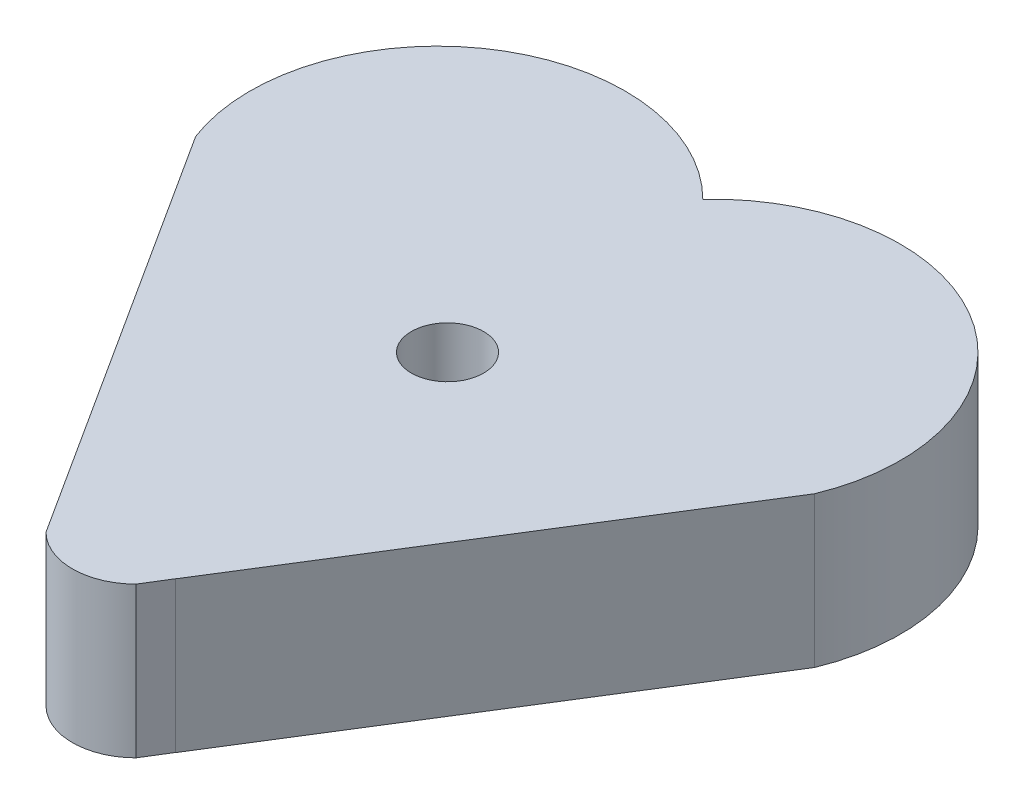
ISO-10303-21;
HEADER;
FILE_DESCRIPTION(('STEP AP214'),'2;1');
FILE_NAME('part.step','',(''),(''),'','','');
FILE_SCHEMA(('AUTOMOTIVE_DESIGN { 1 0 10303 214 1 1 1 1 }'));
ENDSEC;
DATA;
#1=APPLICATION_CONTEXT('core data for automotive mechanical design processes');
#2=APPLICATION_PROTOCOL_DEFINITION('international standard','automotive_design',2000,#1);
#3=PRODUCT_CONTEXT('',#1,'mechanical');
#4=PRODUCT('Part','Part','',(#3));
#5=PRODUCT_RELATED_PRODUCT_CATEGORY('part','',(#4));
#6=PRODUCT_DEFINITION_FORMATION('','',#4);
#7=PRODUCT_DEFINITION_CONTEXT('part definition',#1,'design');
#8=PRODUCT_DEFINITION('design','',#6,#7);
#9=PRODUCT_DEFINITION_SHAPE('','',#8);
#10=(LENGTH_UNIT() NAMED_UNIT(*) SI_UNIT(.MILLI.,.METRE.));
#11=(NAMED_UNIT(*) PLANE_ANGLE_UNIT() SI_UNIT($,.RADIAN.));
#12=(NAMED_UNIT(*) SI_UNIT($,.STERADIAN.) SOLID_ANGLE_UNIT());
#13=UNCERTAINTY_MEASURE_WITH_UNIT(LENGTH_MEASURE(1.E-05),#10,'distance_accuracy_value','');
#14=(GEOMETRIC_REPRESENTATION_CONTEXT(3) GLOBAL_UNCERTAINTY_ASSIGNED_CONTEXT((#13)) GLOBAL_UNIT_ASSIGNED_CONTEXT((#10,
#11,#12)) REPRESENTATION_CONTEXT('',''));
#15=CARTESIAN_POINT('',(0.,0.,0.));
#16=DIRECTION('',(0.,0.,1.));
#17=DIRECTION('',(1.,0.,0.));
#18=AXIS2_PLACEMENT_3D('',#15,#16,#17);
#19=CARTESIAN_POINT('',(4.476994261912,5.08,-4.47699426191201));
#20=DIRECTION('',(0.,-1.,0.));
#21=DIRECTION('',(0.,0.,-1.));
#22=AXIS2_PLACEMENT_3D('',#19,#20,#21);
#23=CYLINDRICAL_SURFACE('',#22,6.33142600386249);
#24=CARTESIAN_POINT('',(4.476994261912,0.,-4.47699426191201));
#25=DIRECTION('',(0.,1.,0.));
#26=DIRECTION('',(0.,0.,1.));
#27=AXIS2_PLACEMENT_3D('',#24,#25,#26);
#28=CIRCLE('',#27,6.33142600386249);
#29=CARTESIAN_POINT('',(10.3291673189757,0.,-2.06058664882935));
#30=VERTEX_POINT('',#29);
#31=CARTESIAN_POINT('',(-0.164422721708759,0.,-8.78329239680036));
#32=VERTEX_POINT('',#31);
#33=EDGE_CURVE('E157',#30,#32,#28,.T.);
#34=ORIENTED_EDGE('',*,*,#33,.T.);
#35=DIRECTION('',(0.,-1.,0.));
#36=VECTOR('',#35,1.);
#37=CARTESIAN_POINT('',(-0.164422721708759,5.08,-8.78329239680036));
#38=LINE('',#37,#36);
#39=CARTESIAN_POINT('',(-0.164422721708759,5.08,-8.78329239680036));
#40=VERTEX_POINT('',#39);
#41=EDGE_CURVE('E11',#40,#32,#38,.T.);
#42=ORIENTED_EDGE('',*,*,#41,.F.);
#43=CARTESIAN_POINT('',(4.476994261912,5.08,-4.47699426191201));
#44=DIRECTION('',(0.,1.,0.));
#45=DIRECTION('',(0.,0.,1.));
#46=AXIS2_PLACEMENT_3D('',#43,#44,#45);
#47=CIRCLE('',#46,6.33142600386249);
#48=CARTESIAN_POINT('',(10.3291673189757,5.08,-2.06058664882935));
#49=VERTEX_POINT('',#48);
#50=EDGE_CURVE('E127',#49,#40,#47,.T.);
#51=ORIENTED_EDGE('',*,*,#50,.F.);
#52=DIRECTION('',(0.,-1.,0.));
#53=VECTOR('',#52,1.);
#54=CARTESIAN_POINT('',(10.3291673189757,5.08,-2.06058664882935));
#55=LINE('',#54,#53);
#56=EDGE_CURVE('E121',#49,#30,#55,.T.);
#57=ORIENTED_EDGE('',*,*,#56,.T.);
#58=EDGE_LOOP('',(#34,#42,#51,#57));
#59=FACE_BOUND('',#58,.T.);
#60=ADVANCED_FACE('F35',(#59),#23,.T.);
#61=CARTESIAN_POINT('',(-4.64141698362076,5.08,-4.30629813488835));
#62=DIRECTION('',(0.,-1.,0.));
#63=DIRECTION('',(0.,0.,-1.));
#64=AXIS2_PLACEMENT_3D('',#61,#62,#63);
#65=CYLINDRICAL_SURFACE('',#64,6.33142600386248);
#66=CARTESIAN_POINT('',(-4.64141698362076,0.,-4.30629813488835));
#67=DIRECTION('',(0.,1.,0.));
#68=DIRECTION('',(0.,0.,1.));
#69=AXIS2_PLACEMENT_3D('',#66,#67,#68);
#70=CIRCLE('',#69,6.33142600386248);
#71=CARTESIAN_POINT('',(-10.5611919087145,0.,-2.06058664882935));
#72=VERTEX_POINT('',#71);
#73=EDGE_CURVE('E155',#32,#72,#70,.T.);
#74=ORIENTED_EDGE('',*,*,#73,.T.);
#75=DIRECTION('',(0.,-1.,0.));
#76=VECTOR('',#75,1.);
#77=CARTESIAN_POINT('',(-10.5611919087145,5.08,-2.06058664882935));
#78=LINE('',#77,#76);
#79=CARTESIAN_POINT('',(-10.5611919087145,5.08,-2.06058664882935));
#80=VERTEX_POINT('',#79);
#81=EDGE_CURVE('E44',#80,#72,#78,.T.);
#82=ORIENTED_EDGE('',*,*,#81,.F.);
#83=CARTESIAN_POINT('',(-4.64141698362076,5.08,-4.30629813488835));
#84=DIRECTION('',(0.,1.,0.));
#85=DIRECTION('',(0.,0.,1.));
#86=AXIS2_PLACEMENT_3D('',#83,#84,#85);
#87=CIRCLE('',#86,6.33142600386248);
#88=EDGE_CURVE('E88',#40,#80,#87,.T.);
#89=ORIENTED_EDGE('',*,*,#88,.F.);
#90=ORIENTED_EDGE('',*,*,#41,.T.);
#91=EDGE_LOOP('',(#74,#82,#89,#90));
#92=FACE_BOUND('',#91,.T.);
#93=ADVANCED_FACE('F177',(#92),#65,.T.);
#94=CARTESIAN_POINT('',(-6.54526239725076,5.08,4.19912507113628));
#95=DIRECTION('',(0.841677864291114,0.,-0.539979974408634));
#96=DIRECTION('',(-0.539979974408634,0.,-0.841677864291114));
#97=AXIS2_PLACEMENT_3D('',#94,#95,#96);
#98=PLANE('',#97);
#99=DIRECTION('',(0.539979974408634,0.,0.841677864291114));
#100=VECTOR('',#99,1.);
#101=CARTESIAN_POINT('',(-6.54526239725076,0.,4.19912507113628));
#102=LINE('',#101,#100);
#103=CARTESIAN_POINT('',(-1.51900155664942,0.,12.0336609616949));
#104=VERTEX_POINT('',#103);
#105=EDGE_CURVE('E150',#72,#104,#102,.T.);
#106=ORIENTED_EDGE('',*,*,#105,.T.);
#107=DIRECTION('',(0.,-1.,0.));
#108=VECTOR('',#107,1.);
#109=CARTESIAN_POINT('',(-1.51900155664942,5.08,12.0336609616949));
#110=LINE('',#109,#108);
#111=CARTESIAN_POINT('',(-1.51900155664942,5.08,12.0336609616949));
#112=VERTEX_POINT('',#111);
#113=EDGE_CURVE('E144',#112,#104,#110,.T.);
#114=ORIENTED_EDGE('',*,*,#113,.F.);
#115=DIRECTION('',(0.539979974408634,0.,0.841677864291114));
#116=VECTOR('',#115,1.);
#117=CARTESIAN_POINT('',(-6.54526239725076,5.08,4.19912507113628));
#118=LINE('',#117,#116);
#119=EDGE_CURVE('E124',#80,#112,#118,.T.);
#120=ORIENTED_EDGE('',*,*,#119,.F.);
#121=ORIENTED_EDGE('',*,*,#81,.T.);
#122=EDGE_LOOP('',(#106,#114,#120,#121));
#123=FACE_BOUND('',#122,.T.);
#124=ADVANCED_FACE('F149',(#123),#98,.F.);
#125=CARTESIAN_POINT('',(0.,5.08,10.5146594050455));
#126=DIRECTION('',(0.,-1.,0.));
#127=DIRECTION('',(0.,0.,-1.));
#128=AXIS2_PLACEMENT_3D('',#125,#126,#127);
#129=CYLINDRICAL_SURFACE('',#128,2.14819260267947);
#130=CARTESIAN_POINT('',(0.,0.,10.5146594050455));
#131=DIRECTION('',(0.,1.,0.));
#132=DIRECTION('',(0.,0.,1.));
#133=AXIS2_PLACEMENT_3D('',#130,#131,#132);
#134=CIRCLE('',#133,2.14819260267947);
#135=CARTESIAN_POINT('',(1.51900155664942,0.,12.0336609616949));
#136=VERTEX_POINT('',#135);
#137=EDGE_CURVE('E138',#104,#136,#134,.T.);
#138=ORIENTED_EDGE('',*,*,#137,.T.);
#139=DIRECTION('',(0.,-1.,0.));
#140=VECTOR('',#139,1.);
#141=CARTESIAN_POINT('',(1.51900155664942,5.08,12.0336609616949));
#142=LINE('',#141,#140);
#143=CARTESIAN_POINT('',(1.51900155664942,5.08,12.0336609616949));
#144=VERTEX_POINT('',#143);
#145=EDGE_CURVE('E117',#144,#136,#142,.T.);
#146=ORIENTED_EDGE('',*,*,#145,.F.);
#147=CARTESIAN_POINT('',(0.,5.08,10.5146594050455));
#148=DIRECTION('',(0.,1.,0.));
#149=DIRECTION('',(0.,0.,1.));
#150=AXIS2_PLACEMENT_3D('',#147,#148,#149);
#151=CIRCLE('',#150,2.14819260267947);
#152=EDGE_CURVE('E104',#112,#144,#151,.T.);
#153=ORIENTED_EDGE('',*,*,#152,.F.);
#154=ORIENTED_EDGE('',*,*,#113,.T.);
#155=EDGE_LOOP('',(#138,#146,#153,#154));
#156=FACE_BOUND('',#155,.T.);
#157=ADVANCED_FACE('F175',(#156),#129,.T.);
#158=CARTESIAN_POINT('',(6.48023825718446,5.08,4.00380957546659));
#159=DIRECTION('',(-0.850721130645072,0.,-0.525617311238862));
#160=DIRECTION('',(-0.525617311238862,0.,0.850721130645072));
#161=AXIS2_PLACEMENT_3D('',#158,#159,#160);
#162=PLANE('',#161);
#163=DIRECTION('',(0.525617311238862,0.,-0.850721130645072));
#164=VECTOR('',#163,1.);
#165=CARTESIAN_POINT('',(6.48023825718446,0.,4.00380957546659));
#166=LINE('',#165,#164);
#167=CARTESIAN_POINT('',(2.03813612236622,0.,11.1934322719994));
#168=VERTEX_POINT('',#167);
#169=EDGE_CURVE('E113',#136,#168,#166,.T.);
#170=ORIENTED_EDGE('',*,*,#169,.T.);
#171=DIRECTION('',(0.,-1.,0.));
#172=VECTOR('',#171,1.);
#173=CARTESIAN_POINT('',(2.03813612236622,5.08,11.1934322719994));
#174=LINE('',#173,#172);
#175=CARTESIAN_POINT('',(2.03813612236622,5.08,11.1934322719994));
#176=VERTEX_POINT('',#175);
#177=EDGE_CURVE('E110',#176,#168,#174,.T.);
#178=ORIENTED_EDGE('',*,*,#177,.F.);
#179=DIRECTION('',(0.525617311238862,0.,-0.850721130645072));
#180=VECTOR('',#179,1.);
#181=CARTESIAN_POINT('',(6.48023825718446,5.08,4.00380957546659));
#182=LINE('',#181,#180);
#183=EDGE_CURVE('E98',#144,#176,#182,.T.);
#184=ORIENTED_EDGE('',*,*,#183,.F.);
#185=ORIENTED_EDGE('',*,*,#145,.T.);
#186=EDGE_LOOP('',(#170,#178,#184,#185));
#187=FACE_BOUND('',#186,.T.);
#188=ADVANCED_FACE('F111',(#187),#162,.F.);
#189=CARTESIAN_POINT('',(2.0309344976521,0.,11.2146854934547));
#190=VERTEX_POINT('',#189);
#191=EDGE_CURVE('E135',#190,#168,#134,.T.);
#192=ORIENTED_EDGE('',*,*,#191,.F.);
#193=DIRECTION('',(0.,-1.,0.));
#194=VECTOR('',#193,1.);
#195=CARTESIAN_POINT('',(2.0309344976521,5.08,11.2146854934547));
#196=LINE('',#195,#194);
#197=CARTESIAN_POINT('',(2.0309344976521,5.08,11.2146854934547));
#198=VERTEX_POINT('',#197);
#199=EDGE_CURVE('E77',#198,#190,#196,.T.);
#200=ORIENTED_EDGE('',*,*,#199,.F.);
#201=EDGE_CURVE('E102',#198,#176,#151,.T.);
#202=ORIENTED_EDGE('',*,*,#201,.T.);
#203=ORIENTED_EDGE('',*,*,#177,.T.);
#204=EDGE_LOOP('',(#192,#200,#202,#203));
#205=FACE_BOUND('',#204,.T.);
#206=ADVANCED_FACE('F119',(#205),#129,.F.);
#207=CARTESIAN_POINT('',(0.,5.08,0.));
#208=DIRECTION('',(0.,-1.,0.));
#209=DIRECTION('',(0.,0.,-1.));
#210=AXIS2_PLACEMENT_3D('',#207,#208,#209);
#211=CYLINDRICAL_SURFACE('',#210,1.21898922149781);
#212=CARTESIAN_POINT('',(0.,5.08,0.));
#213=DIRECTION('',(0.,1.,0.));
#214=DIRECTION('',(0.,0.,1.));
#215=AXIS2_PLACEMENT_3D('',#212,#213,#214);
#216=CIRCLE('',#215,1.21898922149781);
#217=CARTESIAN_POINT('',(0.,5.08,1.21898922149781));
#218=VERTEX_POINT('',#217);
#219=EDGE_CURVE('E131',#218,#218,#216,.T.);
#220=ORIENTED_EDGE('',*,*,#219,.T.);
#221=EDGE_LOOP('',(#220));
#222=FACE_BOUND('',#221,.T.);
#223=CARTESIAN_POINT('',(0.,0.,0.));
#224=DIRECTION('',(0.,1.,0.));
#225=DIRECTION('',(0.,0.,1.));
#226=AXIS2_PLACEMENT_3D('',#223,#224,#225);
#227=CIRCLE('',#226,1.21898922149781);
#228=CARTESIAN_POINT('',(0.,0.,1.21898922149781));
#229=VERTEX_POINT('',#228);
#230=EDGE_CURVE('E162',#229,#229,#227,.T.);
#231=ORIENTED_EDGE('',*,*,#230,.F.);
#232=EDGE_LOOP('',(#231));
#233=FACE_BOUND('',#232,.T.);
#234=ADVANCED_FACE('F37',(#222,#233),#211,.F.);
#235=CARTESIAN_POINT('',(6.50095403508756,5.08,4.06367790924986));
#236=DIRECTION('',(-0.847964204739499,0.,-0.530053494923398));
#237=DIRECTION('',(-0.530053494923398,0.,0.847964204739499));
#238=AXIS2_PLACEMENT_3D('',#235,#236,#237);
#239=PLANE('',#238);
#240=DIRECTION('',(0.530053494923398,0.,-0.847964204739499));
#241=VECTOR('',#240,1.);
#242=CARTESIAN_POINT('',(6.50095403508756,0.,4.06367790924986));
#243=LINE('',#242,#241);
#244=EDGE_CURVE('E80',#190,#30,#243,.T.);
#245=ORIENTED_EDGE('',*,*,#244,.T.);
#246=ORIENTED_EDGE('',*,*,#56,.F.);
#247=DIRECTION('',(0.530053494923398,0.,-0.847964204739499));
#248=VECTOR('',#247,1.);
#249=CARTESIAN_POINT('',(6.50095403508756,5.08,4.06367790924986));
#250=LINE('',#249,#248);
#251=EDGE_CURVE('E52',#198,#49,#250,.T.);
#252=ORIENTED_EDGE('',*,*,#251,.F.);
#253=ORIENTED_EDGE('',*,*,#199,.T.);
#254=EDGE_LOOP('',(#245,#246,#252,#253));
#255=FACE_BOUND('',#254,.T.);
#256=ADVANCED_FACE('F168',(#255),#239,.F.);
#257=CARTESIAN_POINT('',(0.,5.08,0.));
#258=DIRECTION('',(0.,1.,0.));
#259=DIRECTION('',(0.,0.,1.));
#260=AXIS2_PLACEMENT_3D('',#257,#258,#259);
#261=PLANE('',#260);
#262=ORIENTED_EDGE('',*,*,#219,.F.);
#263=EDGE_LOOP('',(#262));
#264=FACE_BOUND('',#263,.T.);
#265=ORIENTED_EDGE('',*,*,#50,.T.);
#266=ORIENTED_EDGE('',*,*,#88,.T.);
#267=ORIENTED_EDGE('',*,*,#119,.T.);
#268=ORIENTED_EDGE('',*,*,#152,.T.);
#269=ORIENTED_EDGE('',*,*,#183,.T.);
#270=ORIENTED_EDGE('',*,*,#201,.F.);
#271=ORIENTED_EDGE('',*,*,#251,.T.);
#272=EDGE_LOOP('',(#265,#266,#267,#268,#269,#270,#271));
#273=FACE_BOUND('',#272,.T.);
#274=ADVANCED_FACE('F100',(#264,#273),#261,.T.);
#275=CARTESIAN_POINT('',(0.,0.,0.));
#276=DIRECTION('',(0.,1.,0.));
#277=DIRECTION('',(0.,0.,1.));
#278=AXIS2_PLACEMENT_3D('',#275,#276,#277);
#279=PLANE('',#278);
#280=ORIENTED_EDGE('',*,*,#230,.T.);
#281=EDGE_LOOP('',(#280));
#282=FACE_BOUND('',#281,.T.);
#283=ORIENTED_EDGE('',*,*,#33,.F.);
#284=ORIENTED_EDGE('',*,*,#244,.F.);
#285=ORIENTED_EDGE('',*,*,#191,.T.);
#286=ORIENTED_EDGE('',*,*,#169,.F.);
#287=ORIENTED_EDGE('',*,*,#137,.F.);
#288=ORIENTED_EDGE('',*,*,#105,.F.);
#289=ORIENTED_EDGE('',*,*,#73,.F.);
#290=EDGE_LOOP('',(#283,#284,#285,#286,#287,#288,#289));
#291=FACE_BOUND('',#290,.T.);
#292=ADVANCED_FACE('F154',(#282,#291),#279,.F.);
#293=CLOSED_SHELL('',(#60,#93,#124,#157,#188,#206,#234,#256,#274,#292));
#294=MANIFOLD_SOLID_BREP('B2',#293);
#295=ADVANCED_BREP_SHAPE_REPRESENTATION('',(#18,#294),#14);
#296=SHAPE_DEFINITION_REPRESENTATION(#9,#295);
ENDSEC;
END-ISO-10303-21;
